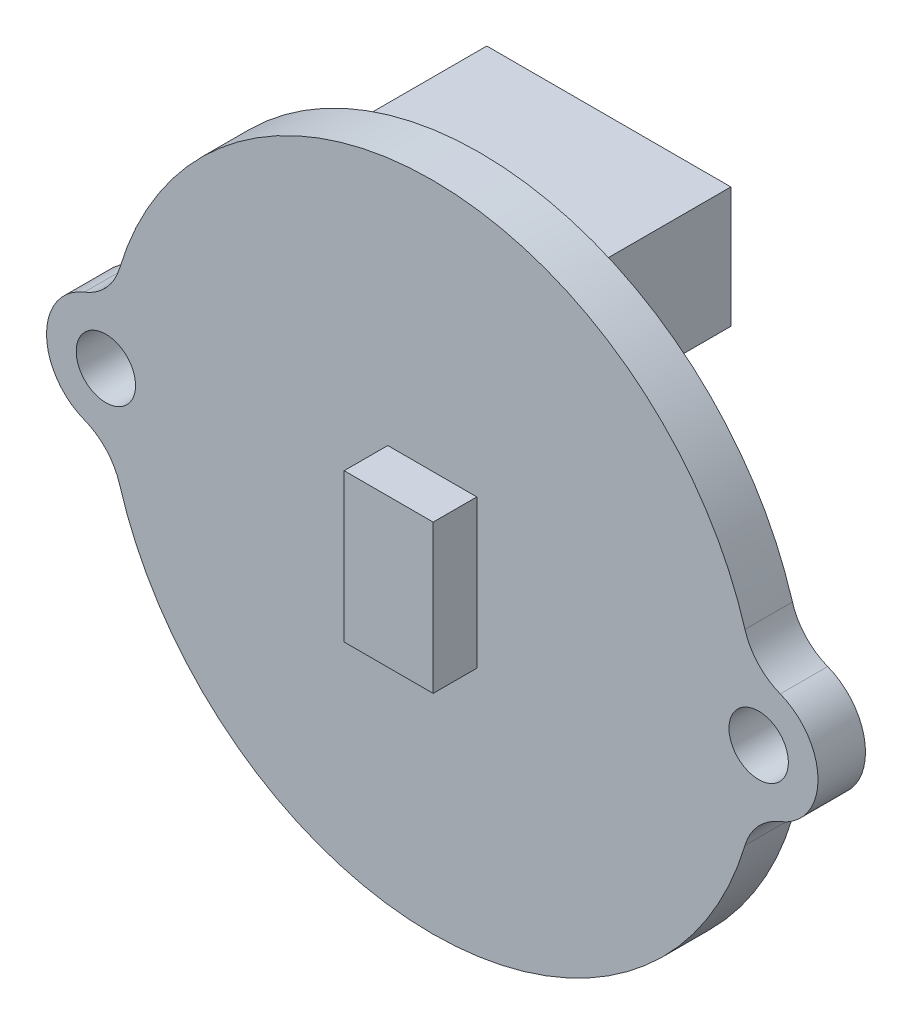
ISO-10303-21;
HEADER;
FILE_DESCRIPTION(('STEP AP214'),'2;1');
FILE_NAME('part.step','',(''),(''),'','','');
FILE_SCHEMA(('AUTOMOTIVE_DESIGN { 1 0 10303 214 1 1 1 1 }'));
ENDSEC;
DATA;
#1=APPLICATION_CONTEXT('core data for automotive mechanical design processes');
#2=APPLICATION_PROTOCOL_DEFINITION('international standard','automotive_design',2000,#1);
#3=PRODUCT_CONTEXT('',#1,'mechanical');
#4=PRODUCT('Part','Part','',(#3));
#5=PRODUCT_RELATED_PRODUCT_CATEGORY('part','',(#4));
#6=PRODUCT_DEFINITION_FORMATION('','',#4);
#7=PRODUCT_DEFINITION_CONTEXT('part definition',#1,'design');
#8=PRODUCT_DEFINITION('design','',#6,#7);
#9=PRODUCT_DEFINITION_SHAPE('','',#8);
#10=(LENGTH_UNIT() NAMED_UNIT(*) SI_UNIT(.MILLI.,.METRE.));
#11=(NAMED_UNIT(*) PLANE_ANGLE_UNIT() SI_UNIT($,.RADIAN.));
#12=(NAMED_UNIT(*) SI_UNIT($,.STERADIAN.) SOLID_ANGLE_UNIT());
#13=UNCERTAINTY_MEASURE_WITH_UNIT(LENGTH_MEASURE(1.E-05),#10,'distance_accuracy_value','');
#14=(GEOMETRIC_REPRESENTATION_CONTEXT(3) GLOBAL_UNCERTAINTY_ASSIGNED_CONTEXT((#13)) GLOBAL_UNIT_ASSIGNED_CONTEXT((#10,
#11,#12)) REPRESENTATION_CONTEXT('',''));
#15=CARTESIAN_POINT('',(0.,0.,0.));
#16=DIRECTION('',(0.,0.,1.));
#17=DIRECTION('',(1.,0.,0.));
#18=AXIS2_PLACEMENT_3D('',#15,#16,#17);
#19=CARTESIAN_POINT('',(11.7272727272727,1.8630819574472,0.));
#20=DIRECTION('',(0.,0.,1.));
#21=DIRECTION('',(1.,0.,0.));
#22=AXIS2_PLACEMENT_3D('',#19,#20,#21);
#23=PLANE('',#22);
#24=CARTESIAN_POINT('',(11.,0.,0.));
#25=DIRECTION('',(0.,0.,1.));
#26=DIRECTION('',(-1.,0.,0.));
#27=AXIS2_PLACEMENT_3D('',#24,#25,#26);
#28=CIRCLE('',#27,1.);
#29=CARTESIAN_POINT('',(10.,0.,0.));
#30=VERTEX_POINT('',#29);
#31=EDGE_CURVE('E201',#30,#30,#28,.T.);
#32=ORIENTED_EDGE('',*,*,#31,.T.);
#33=EDGE_LOOP('',(#32));
#34=FACE_BOUND('',#33,.T.);
#35=CARTESIAN_POINT('',(-11.,0.,0.));
#36=DIRECTION('',(0.,0.,1.));
#37=DIRECTION('',(1.,0.,0.));
#38=AXIS2_PLACEMENT_3D('',#35,#36,#37);
#39=CIRCLE('',#38,1.);
#40=CARTESIAN_POINT('',(-10.,0.,0.));
#41=VERTEX_POINT('',#40);
#42=EDGE_CURVE('E205',#41,#41,#39,.T.);
#43=ORIENTED_EDGE('',*,*,#42,.T.);
#44=EDGE_LOOP('',(#43));
#45=FACE_BOUND('',#44,.T.);
#46=CARTESIAN_POINT('',(12.4545454545455,3.7261639148944,0.));
#47=DIRECTION('',(0.,0.,-1.));
#48=DIRECTION('',(1.,0.,0.));
#49=AXIS2_PLACEMENT_3D('',#46,#47,#48);
#50=CIRCLE('',#49,2.);
#51=CARTESIAN_POINT('',(11.7272727272727,1.8630819574472,0.));
#52=VERTEX_POINT('',#51);
#53=CARTESIAN_POINT('',(10.5384615384615,3.15290792798757,0.));
#54=VERTEX_POINT('',#53);
#55=EDGE_CURVE('E211',#52,#54,#50,.T.);
#56=ORIENTED_EDGE('',*,*,#55,.F.);
#57=CARTESIAN_POINT('',(11.,0.,0.));
#58=DIRECTION('',(0.,0.,1.));
#59=DIRECTION('',(-1.,0.,0.));
#60=AXIS2_PLACEMENT_3D('',#57,#58,#59);
#61=CIRCLE('',#60,2.);
#62=CARTESIAN_POINT('',(11.7272727272727,-1.8630819574472,0.));
#63=VERTEX_POINT('',#62);
#64=EDGE_CURVE('E218',#63,#52,#61,.T.);
#65=ORIENTED_EDGE('',*,*,#64,.F.);
#66=CARTESIAN_POINT('',(12.4545454545455,-3.7261639148944,0.));
#67=DIRECTION('',(0.,0.,-1.));
#68=DIRECTION('',(-1.,0.,0.));
#69=AXIS2_PLACEMENT_3D('',#66,#67,#68);
#70=CIRCLE('',#69,2.);
#71=CARTESIAN_POINT('',(10.5384615384615,-3.15290792798757,0.));
#72=VERTEX_POINT('',#71);
#73=EDGE_CURVE('E245',#72,#63,#70,.T.);
#74=ORIENTED_EDGE('',*,*,#73,.F.);
#75=CARTESIAN_POINT('',(0.,0.,0.));
#76=DIRECTION('',(0.,0.,1.));
#77=DIRECTION('',(1.,0.,0.));
#78=AXIS2_PLACEMENT_3D('',#75,#76,#77);
#79=CIRCLE('',#78,11.);
#80=CARTESIAN_POINT('',(-10.5384615384615,-3.15290792798758,0.));
#81=VERTEX_POINT('',#80);
#82=EDGE_CURVE('E243',#81,#72,#79,.T.);
#83=ORIENTED_EDGE('',*,*,#82,.F.);
#84=CARTESIAN_POINT('',(-12.4545454545455,-3.72616391489441,0.));
#85=DIRECTION('',(0.,0.,-1.));
#86=DIRECTION('',(1.,0.,0.));
#87=AXIS2_PLACEMENT_3D('',#84,#85,#86);
#88=CIRCLE('',#87,2.);
#89=CARTESIAN_POINT('',(-11.7272727272727,-1.8630819574472,0.));
#90=VERTEX_POINT('',#89);
#91=EDGE_CURVE('E241',#90,#81,#88,.T.);
#92=ORIENTED_EDGE('',*,*,#91,.F.);
#93=CARTESIAN_POINT('',(-11.,0.,0.));
#94=DIRECTION('',(0.,0.,1.));
#95=DIRECTION('',(1.,0.,0.));
#96=AXIS2_PLACEMENT_3D('',#93,#94,#95);
#97=CIRCLE('',#96,2.00000000000001);
#98=CARTESIAN_POINT('',(-11.7272727272727,1.8630819574472,0.));
#99=VERTEX_POINT('',#98);
#100=EDGE_CURVE('E239',#99,#90,#97,.T.);
#101=ORIENTED_EDGE('',*,*,#100,.F.);
#102=CARTESIAN_POINT('',(-12.4545454545455,3.7261639148944,0.));
#103=DIRECTION('',(0.,0.,-1.));
#104=DIRECTION('',(1.,0.,0.));
#105=AXIS2_PLACEMENT_3D('',#102,#103,#104);
#106=CIRCLE('',#105,2.);
#107=CARTESIAN_POINT('',(-10.5384615384615,3.15290792798757,0.));
#108=VERTEX_POINT('',#107);
#109=EDGE_CURVE('E237',#108,#99,#106,.T.);
#110=ORIENTED_EDGE('',*,*,#109,.F.);
#111=CARTESIAN_POINT('',(0.,0.,0.));
#112=DIRECTION('',(0.,0.,1.));
#113=DIRECTION('',(1.,0.,0.));
#114=AXIS2_PLACEMENT_3D('',#111,#112,#113);
#115=CIRCLE('',#114,11.);
#116=EDGE_CURVE('E235',#54,#108,#115,.T.);
#117=ORIENTED_EDGE('',*,*,#116,.F.);
#118=EDGE_LOOP('',(#56,#65,#74,#83,#92,#101,#110,#117));
#119=FACE_BOUND('',#118,.T.);
#120=DIRECTION('',(0.,-1.,0.));
#121=VECTOR('',#120,1.);
#122=CARTESIAN_POINT('',(4.113,9.879,0.));
#123=LINE('',#122,#121);
#124=CARTESIAN_POINT('',(4.113,9.879,0.));
#125=VERTEX_POINT('',#124);
#126=CARTESIAN_POINT('',(4.113,5.81,0.));
#127=VERTEX_POINT('',#126);
#128=EDGE_CURVE('E166',#125,#127,#123,.T.);
#129=ORIENTED_EDGE('',*,*,#128,.F.);
#130=DIRECTION('',(1.,0.,0.));
#131=VECTOR('',#130,1.);
#132=CARTESIAN_POINT('',(-4.113,9.879,0.));
#133=LINE('',#132,#131);
#134=CARTESIAN_POINT('',(-4.113,9.879,0.));
#135=VERTEX_POINT('',#134);
#136=EDGE_CURVE('E163',#135,#125,#133,.T.);
#137=ORIENTED_EDGE('',*,*,#136,.F.);
#138=DIRECTION('',(0.,1.,0.));
#139=VECTOR('',#138,1.);
#140=CARTESIAN_POINT('',(-4.113,9.879,0.));
#141=LINE('',#140,#139);
#142=CARTESIAN_POINT('',(-4.113,5.81,0.));
#143=VERTEX_POINT('',#142);
#144=EDGE_CURVE('E53',#143,#135,#141,.T.);
#145=ORIENTED_EDGE('',*,*,#144,.F.);
#146=DIRECTION('',(-1.,0.,0.));
#147=VECTOR('',#146,1.);
#148=CARTESIAN_POINT('',(-4.113,5.81,0.));
#149=LINE('',#148,#147);
#150=EDGE_CURVE('E48',#127,#143,#149,.T.);
#151=ORIENTED_EDGE('',*,*,#150,.F.);
#152=EDGE_LOOP('',(#129,#137,#145,#151));
#153=FACE_BOUND('',#152,.T.);
#154=ADVANCED_FACE('F33',(#34,#45,#119,#153),#23,.F.);
#155=CARTESIAN_POINT('',(11.7272727272727,1.8630819574472,1.6));
#156=DIRECTION('',(0.,0.,1.));
#157=DIRECTION('',(1.,0.,0.));
#158=AXIS2_PLACEMENT_3D('',#155,#156,#157);
#159=PLANE('',#158);
#160=CARTESIAN_POINT('',(-11.,0.,1.6));
#161=DIRECTION('',(0.,0.,1.));
#162=DIRECTION('',(1.,0.,0.));
#163=AXIS2_PLACEMENT_3D('',#160,#161,#162);
#164=CIRCLE('',#163,1.);
#165=CARTESIAN_POINT('',(-10.,0.,1.6));
#166=VERTEX_POINT('',#165);
#167=EDGE_CURVE('E208',#166,#166,#164,.T.);
#168=ORIENTED_EDGE('',*,*,#167,.F.);
#169=EDGE_LOOP('',(#168));
#170=FACE_BOUND('',#169,.T.);
#171=CARTESIAN_POINT('',(12.4545454545455,3.7261639148944,1.6));
#172=DIRECTION('',(0.,0.,-1.));
#173=DIRECTION('',(1.,0.,0.));
#174=AXIS2_PLACEMENT_3D('',#171,#172,#173);
#175=CIRCLE('',#174,2.);
#176=CARTESIAN_POINT('',(11.7272727272727,1.8630819574472,1.6));
#177=VERTEX_POINT('',#176);
#178=CARTESIAN_POINT('',(10.5384615384615,3.15290792798757,1.6));
#179=VERTEX_POINT('',#178);
#180=EDGE_CURVE('E214',#177,#179,#175,.T.);
#181=ORIENTED_EDGE('',*,*,#180,.T.);
#182=CARTESIAN_POINT('',(0.,0.,1.6));
#183=DIRECTION('',(0.,0.,1.));
#184=DIRECTION('',(1.,0.,0.));
#185=AXIS2_PLACEMENT_3D('',#182,#183,#184);
#186=CIRCLE('',#185,11.);
#187=CARTESIAN_POINT('',(-10.5384615384615,3.15290792798757,1.6));
#188=VERTEX_POINT('',#187);
#189=EDGE_CURVE('E217',#179,#188,#186,.T.);
#190=ORIENTED_EDGE('',*,*,#189,.T.);
#191=CARTESIAN_POINT('',(-12.4545454545455,3.7261639148944,1.6));
#192=DIRECTION('',(0.,0.,-1.));
#193=DIRECTION('',(1.,0.,0.));
#194=AXIS2_PLACEMENT_3D('',#191,#192,#193);
#195=CIRCLE('',#194,2.);
#196=CARTESIAN_POINT('',(-11.7272727272727,1.8630819574472,1.6));
#197=VERTEX_POINT('',#196);
#198=EDGE_CURVE('E220',#188,#197,#195,.T.);
#199=ORIENTED_EDGE('',*,*,#198,.T.);
#200=CARTESIAN_POINT('',(-11.,0.,1.6));
#201=DIRECTION('',(0.,0.,1.));
#202=DIRECTION('',(1.,0.,0.));
#203=AXIS2_PLACEMENT_3D('',#200,#201,#202);
#204=CIRCLE('',#203,2.00000000000001);
#205=CARTESIAN_POINT('',(-11.7272727272727,-1.8630819574472,1.6));
#206=VERTEX_POINT('',#205);
#207=EDGE_CURVE('E222',#197,#206,#204,.T.);
#208=ORIENTED_EDGE('',*,*,#207,.T.);
#209=CARTESIAN_POINT('',(-12.4545454545455,-3.72616391489441,1.6));
#210=DIRECTION('',(0.,0.,-1.));
#211=DIRECTION('',(1.,0.,0.));
#212=AXIS2_PLACEMENT_3D('',#209,#210,#211);
#213=CIRCLE('',#212,2.);
#214=CARTESIAN_POINT('',(-10.5384615384615,-3.15290792798758,1.6));
#215=VERTEX_POINT('',#214);
#216=EDGE_CURVE('E224',#206,#215,#213,.T.);
#217=ORIENTED_EDGE('',*,*,#216,.T.);
#218=CARTESIAN_POINT('',(0.,0.,1.6));
#219=DIRECTION('',(0.,0.,1.));
#220=DIRECTION('',(1.,0.,0.));
#221=AXIS2_PLACEMENT_3D('',#218,#219,#220);
#222=CIRCLE('',#221,11.);
#223=CARTESIAN_POINT('',(10.5384615384615,-3.15290792798757,1.6));
#224=VERTEX_POINT('',#223);
#225=EDGE_CURVE('E226',#215,#224,#222,.T.);
#226=ORIENTED_EDGE('',*,*,#225,.T.);
#227=CARTESIAN_POINT('',(12.4545454545455,-3.7261639148944,1.6));
#228=DIRECTION('',(0.,0.,-1.));
#229=DIRECTION('',(-1.,0.,0.));
#230=AXIS2_PLACEMENT_3D('',#227,#228,#229);
#231=CIRCLE('',#230,2.);
#232=CARTESIAN_POINT('',(11.7272727272727,-1.8630819574472,1.6));
#233=VERTEX_POINT('',#232);
#234=EDGE_CURVE('E228',#224,#233,#231,.T.);
#235=ORIENTED_EDGE('',*,*,#234,.T.);
#236=CARTESIAN_POINT('',(11.,0.,1.6));
#237=DIRECTION('',(0.,0.,1.));
#238=DIRECTION('',(-1.,0.,0.));
#239=AXIS2_PLACEMENT_3D('',#236,#237,#238);
#240=CIRCLE('',#239,2.);
#241=EDGE_CURVE('E230',#233,#177,#240,.T.);
#242=ORIENTED_EDGE('',*,*,#241,.T.);
#243=EDGE_LOOP('',(#181,#190,#199,#208,#217,#226,#235,#242));
#244=FACE_BOUND('',#243,.T.);
#245=CARTESIAN_POINT('',(11.,0.,1.6));
#246=DIRECTION('',(0.,0.,1.));
#247=DIRECTION('',(-1.,0.,0.));
#248=AXIS2_PLACEMENT_3D('',#245,#246,#247);
#249=CIRCLE('',#248,1.);
#250=CARTESIAN_POINT('',(10.,0.,1.6));
#251=VERTEX_POINT('',#250);
#252=EDGE_CURVE('E202',#251,#251,#249,.T.);
#253=ORIENTED_EDGE('',*,*,#252,.F.);
#254=EDGE_LOOP('',(#253));
#255=FACE_BOUND('',#254,.T.);
#256=DIRECTION('',(1.,0.,0.));
#257=VECTOR('',#256,1.);
#258=CARTESIAN_POINT('',(1.5,-2.5,1.6));
#259=LINE('',#258,#257);
#260=CARTESIAN_POINT('',(-1.5,-2.5,1.6));
#261=VERTEX_POINT('',#260);
#262=CARTESIAN_POINT('',(1.5,-2.5,1.6));
#263=VERTEX_POINT('',#262);
#264=EDGE_CURVE('E170',#261,#263,#259,.T.);
#265=ORIENTED_EDGE('',*,*,#264,.F.);
#266=DIRECTION('',(0.,-1.,0.));
#267=VECTOR('',#266,1.);
#268=CARTESIAN_POINT('',(-1.5,-2.5,1.6));
#269=LINE('',#268,#267);
#270=CARTESIAN_POINT('',(-1.5,2.5,1.6));
#271=VERTEX_POINT('',#270);
#272=EDGE_CURVE('E167',#271,#261,#269,.T.);
#273=ORIENTED_EDGE('',*,*,#272,.F.);
#274=DIRECTION('',(-1.,0.,0.));
#275=VECTOR('',#274,1.);
#276=CARTESIAN_POINT('',(1.5,2.5,1.6));
#277=LINE('',#276,#275);
#278=CARTESIAN_POINT('',(1.5,2.5,1.6));
#279=VERTEX_POINT('',#278);
#280=EDGE_CURVE('E180',#279,#271,#277,.T.);
#281=ORIENTED_EDGE('',*,*,#280,.F.);
#282=DIRECTION('',(0.,1.,0.));
#283=VECTOR('',#282,1.);
#284=CARTESIAN_POINT('',(1.5,-2.5,1.6));
#285=LINE('',#284,#283);
#286=EDGE_CURVE('E188',#263,#279,#285,.T.);
#287=ORIENTED_EDGE('',*,*,#286,.F.);
#288=EDGE_LOOP('',(#265,#273,#281,#287));
#289=FACE_BOUND('',#288,.T.);
#290=ADVANCED_FACE('F287',(#170,#244,#255,#289),#159,.T.);
#291=CARTESIAN_POINT('',(12.4545454545455,3.7261639148944,1.6));
#292=DIRECTION('',(0.,0.,-1.));
#293=DIRECTION('',(-1.,0.,0.));
#294=AXIS2_PLACEMENT_3D('',#291,#292,#293);
#295=CYLINDRICAL_SURFACE('',#294,2.);
#296=ORIENTED_EDGE('',*,*,#55,.T.);
#297=DIRECTION('',(0.,0.,-1.));
#298=VECTOR('',#297,1.);
#299=CARTESIAN_POINT('',(10.5384615384615,3.15290792798757,1.6));
#300=LINE('',#299,#298);
#301=EDGE_CURVE('E11',#179,#54,#300,.T.);
#302=ORIENTED_EDGE('',*,*,#301,.F.);
#303=ORIENTED_EDGE('',*,*,#180,.F.);
#304=DIRECTION('',(0.,0.,-1.));
#305=VECTOR('',#304,1.);
#306=CARTESIAN_POINT('',(11.7272727272727,1.8630819574472,1.6));
#307=LINE('',#306,#305);
#308=EDGE_CURVE('E232',#177,#52,#307,.T.);
#309=ORIENTED_EDGE('',*,*,#308,.T.);
#310=EDGE_LOOP('',(#296,#302,#303,#309));
#311=FACE_BOUND('',#310,.T.);
#312=ADVANCED_FACE('F35',(#311),#295,.F.);
#313=CARTESIAN_POINT('',(0.,0.,1.6));
#314=DIRECTION('',(0.,0.,-1.));
#315=DIRECTION('',(-1.,0.,0.));
#316=AXIS2_PLACEMENT_3D('',#313,#314,#315);
#317=CYLINDRICAL_SURFACE('',#316,11.);
#318=ORIENTED_EDGE('',*,*,#116,.T.);
#319=DIRECTION('',(0.,0.,-1.));
#320=VECTOR('',#319,1.);
#321=CARTESIAN_POINT('',(-10.5384615384615,3.15290792798757,1.6));
#322=LINE('',#321,#320);
#323=EDGE_CURVE('E41',#188,#108,#322,.T.);
#324=ORIENTED_EDGE('',*,*,#323,.F.);
#325=ORIENTED_EDGE('',*,*,#189,.F.);
#326=ORIENTED_EDGE('',*,*,#301,.T.);
#327=EDGE_LOOP('',(#318,#324,#325,#326));
#328=FACE_BOUND('',#327,.T.);
#329=ADVANCED_FACE('F292',(#328),#317,.T.);
#330=CARTESIAN_POINT('',(-12.4545454545455,3.7261639148944,1.6));
#331=DIRECTION('',(0.,0.,-1.));
#332=DIRECTION('',(-1.,0.,0.));
#333=AXIS2_PLACEMENT_3D('',#330,#331,#332);
#334=CYLINDRICAL_SURFACE('',#333,2.);
#335=ORIENTED_EDGE('',*,*,#109,.T.);
#336=DIRECTION('',(0.,0.,-1.));
#337=VECTOR('',#336,1.);
#338=CARTESIAN_POINT('',(-11.7272727272727,1.8630819574472,1.6));
#339=LINE('',#338,#337);
#340=EDGE_CURVE('E262',#197,#99,#339,.T.);
#341=ORIENTED_EDGE('',*,*,#340,.F.);
#342=ORIENTED_EDGE('',*,*,#198,.F.);
#343=ORIENTED_EDGE('',*,*,#323,.T.);
#344=EDGE_LOOP('',(#335,#341,#342,#343));
#345=FACE_BOUND('',#344,.T.);
#346=ADVANCED_FACE('F269',(#345),#334,.F.);
#347=CARTESIAN_POINT('',(-11.,0.,1.6));
#348=DIRECTION('',(0.,0.,-1.));
#349=DIRECTION('',(-1.,0.,0.));
#350=AXIS2_PLACEMENT_3D('',#347,#348,#349);
#351=CYLINDRICAL_SURFACE('',#350,2.00000000000001);
#352=ORIENTED_EDGE('',*,*,#100,.T.);
#353=DIRECTION('',(0.,0.,-1.));
#354=VECTOR('',#353,1.);
#355=CARTESIAN_POINT('',(-11.7272727272727,-1.8630819574472,1.6));
#356=LINE('',#355,#354);
#357=EDGE_CURVE('E259',#206,#90,#356,.T.);
#358=ORIENTED_EDGE('',*,*,#357,.F.);
#359=ORIENTED_EDGE('',*,*,#207,.F.);
#360=ORIENTED_EDGE('',*,*,#340,.T.);
#361=EDGE_LOOP('',(#352,#358,#359,#360));
#362=FACE_BOUND('',#361,.T.);
#363=ADVANCED_FACE('F279',(#362),#351,.T.);
#364=CARTESIAN_POINT('',(-12.4545454545455,-3.72616391489441,1.6));
#365=DIRECTION('',(0.,0.,-1.));
#366=DIRECTION('',(-1.,0.,0.));
#367=AXIS2_PLACEMENT_3D('',#364,#365,#366);
#368=CYLINDRICAL_SURFACE('',#367,2.);
#369=ORIENTED_EDGE('',*,*,#91,.T.);
#370=DIRECTION('',(0.,0.,-1.));
#371=VECTOR('',#370,1.);
#372=CARTESIAN_POINT('',(-10.5384615384615,-3.15290792798758,1.6));
#373=LINE('',#372,#371);
#374=EDGE_CURVE('E256',#215,#81,#373,.T.);
#375=ORIENTED_EDGE('',*,*,#374,.F.);
#376=ORIENTED_EDGE('',*,*,#216,.F.);
#377=ORIENTED_EDGE('',*,*,#357,.T.);
#378=EDGE_LOOP('',(#369,#375,#376,#377));
#379=FACE_BOUND('',#378,.T.);
#380=ADVANCED_FACE('F283',(#379),#368,.F.);
#381=CARTESIAN_POINT('',(0.,0.,1.6));
#382=DIRECTION('',(0.,0.,-1.));
#383=DIRECTION('',(-1.,0.,0.));
#384=AXIS2_PLACEMENT_3D('',#381,#382,#383);
#385=CYLINDRICAL_SURFACE('',#384,11.);
#386=ORIENTED_EDGE('',*,*,#82,.T.);
#387=DIRECTION('',(0.,0.,-1.));
#388=VECTOR('',#387,1.);
#389=CARTESIAN_POINT('',(10.5384615384615,-3.15290792798757,1.6));
#390=LINE('',#389,#388);
#391=EDGE_CURVE('E253',#224,#72,#390,.T.);
#392=ORIENTED_EDGE('',*,*,#391,.F.);
#393=ORIENTED_EDGE('',*,*,#225,.F.);
#394=ORIENTED_EDGE('',*,*,#374,.T.);
#395=EDGE_LOOP('',(#386,#392,#393,#394));
#396=FACE_BOUND('',#395,.T.);
#397=ADVANCED_FACE('F305',(#396),#385,.T.);
#398=CARTESIAN_POINT('',(12.4545454545455,-3.7261639148944,1.6));
#399=DIRECTION('',(0.,0.,-1.));
#400=DIRECTION('',(-1.,0.,0.));
#401=AXIS2_PLACEMENT_3D('',#398,#399,#400);
#402=CYLINDRICAL_SURFACE('',#401,2.);
#403=ORIENTED_EDGE('',*,*,#73,.T.);
#404=DIRECTION('',(0.,0.,-1.));
#405=VECTOR('',#404,1.);
#406=CARTESIAN_POINT('',(11.7272727272727,-1.8630819574472,1.6));
#407=LINE('',#406,#405);
#408=EDGE_CURVE('E250',#233,#63,#407,.T.);
#409=ORIENTED_EDGE('',*,*,#408,.F.);
#410=ORIENTED_EDGE('',*,*,#234,.F.);
#411=ORIENTED_EDGE('',*,*,#391,.T.);
#412=EDGE_LOOP('',(#403,#409,#410,#411));
#413=FACE_BOUND('',#412,.T.);
#414=ADVANCED_FACE('F303',(#413),#402,.F.);
#415=CARTESIAN_POINT('',(11.,0.,1.6));
#416=DIRECTION('',(0.,0.,-1.));
#417=DIRECTION('',(-1.,0.,0.));
#418=AXIS2_PLACEMENT_3D('',#415,#416,#417);
#419=CYLINDRICAL_SURFACE('',#418,2.);
#420=ORIENTED_EDGE('',*,*,#64,.T.);
#421=ORIENTED_EDGE('',*,*,#308,.F.);
#422=ORIENTED_EDGE('',*,*,#241,.F.);
#423=ORIENTED_EDGE('',*,*,#408,.T.);
#424=EDGE_LOOP('',(#420,#421,#422,#423));
#425=FACE_BOUND('',#424,.T.);
#426=ADVANCED_FACE('F298',(#425),#419,.T.);
#427=CARTESIAN_POINT('',(-11.,0.,1.6));
#428=DIRECTION('',(0.,0.,-1.));
#429=DIRECTION('',(-1.,0.,0.));
#430=AXIS2_PLACEMENT_3D('',#427,#428,#429);
#431=CYLINDRICAL_SURFACE('',#430,1.);
#432=ORIENTED_EDGE('',*,*,#167,.T.);
#433=EDGE_LOOP('',(#432));
#434=FACE_BOUND('',#433,.T.);
#435=ORIENTED_EDGE('',*,*,#42,.F.);
#436=EDGE_LOOP('',(#435));
#437=FACE_BOUND('',#436,.T.);
#438=ADVANCED_FACE('F326',(#434,#437),#431,.F.);
#439=CARTESIAN_POINT('',(11.,0.,1.6));
#440=DIRECTION('',(0.,0.,-1.));
#441=DIRECTION('',(-1.,0.,0.));
#442=AXIS2_PLACEMENT_3D('',#439,#440,#441);
#443=CYLINDRICAL_SURFACE('',#442,1.);
#444=ORIENTED_EDGE('',*,*,#252,.T.);
#445=EDGE_LOOP('',(#444));
#446=FACE_BOUND('',#445,.T.);
#447=ORIENTED_EDGE('',*,*,#31,.F.);
#448=EDGE_LOOP('',(#447));
#449=FACE_BOUND('',#448,.T.);
#450=ADVANCED_FACE('F330',(#446,#449),#443,.F.);
#451=CARTESIAN_POINT('',(-1.5,-2.5,3.07));
#452=DIRECTION('',(1.,0.,0.));
#453=DIRECTION('',(0.,0.,-1.));
#454=AXIS2_PLACEMENT_3D('',#451,#452,#453);
#455=PLANE('',#454);
#456=ORIENTED_EDGE('',*,*,#272,.T.);
#457=DIRECTION('',(0.,0.,-1.));
#458=VECTOR('',#457,1.);
#459=CARTESIAN_POINT('',(-1.5,-2.5,3.07));
#460=LINE('',#459,#458);
#461=CARTESIAN_POINT('',(-1.5,-2.5,3.07));
#462=VERTEX_POINT('',#461);
#463=EDGE_CURVE('E199',#462,#261,#460,.T.);
#464=ORIENTED_EDGE('',*,*,#463,.F.);
#465=DIRECTION('',(0.,-1.,0.));
#466=VECTOR('',#465,1.);
#467=CARTESIAN_POINT('',(-1.5,-2.5,3.07));
#468=LINE('',#467,#466);
#469=CARTESIAN_POINT('',(-1.5,2.5,3.07));
#470=VERTEX_POINT('',#469);
#471=EDGE_CURVE('E176',#470,#462,#468,.T.);
#472=ORIENTED_EDGE('',*,*,#471,.F.);
#473=DIRECTION('',(0.,0.,-1.));
#474=VECTOR('',#473,1.);
#475=CARTESIAN_POINT('',(-1.5,2.5,3.07));
#476=LINE('',#475,#474);
#477=EDGE_CURVE('E185',#470,#271,#476,.T.);
#478=ORIENTED_EDGE('',*,*,#477,.T.);
#479=EDGE_LOOP('',(#456,#464,#472,#478));
#480=FACE_BOUND('',#479,.T.);
#481=ADVANCED_FACE('F335',(#480),#455,.F.);
#482=CARTESIAN_POINT('',(1.5,-2.5,3.07));
#483=DIRECTION('',(0.,1.,0.));
#484=DIRECTION('',(0.,0.,1.));
#485=AXIS2_PLACEMENT_3D('',#482,#483,#484);
#486=PLANE('',#485);
#487=ORIENTED_EDGE('',*,*,#264,.T.);
#488=DIRECTION('',(0.,0.,-1.));
#489=VECTOR('',#488,1.);
#490=CARTESIAN_POINT('',(1.5,-2.5,3.07));
#491=LINE('',#490,#489);
#492=CARTESIAN_POINT('',(1.5,-2.5,3.07));
#493=VERTEX_POINT('',#492);
#494=EDGE_CURVE('E196',#493,#263,#491,.T.);
#495=ORIENTED_EDGE('',*,*,#494,.F.);
#496=DIRECTION('',(1.,0.,0.));
#497=VECTOR('',#496,1.);
#498=CARTESIAN_POINT('',(1.5,-2.5,3.07));
#499=LINE('',#498,#497);
#500=EDGE_CURVE('E179',#462,#493,#499,.T.);
#501=ORIENTED_EDGE('',*,*,#500,.F.);
#502=ORIENTED_EDGE('',*,*,#463,.T.);
#503=EDGE_LOOP('',(#487,#495,#501,#502));
#504=FACE_BOUND('',#503,.T.);
#505=ADVANCED_FACE('F342',(#504),#486,.F.);
#506=CARTESIAN_POINT('',(1.5,-2.5,3.07));
#507=DIRECTION('',(-1.,0.,0.));
#508=DIRECTION('',(0.,0.,1.));
#509=AXIS2_PLACEMENT_3D('',#506,#507,#508);
#510=PLANE('',#509);
#511=ORIENTED_EDGE('',*,*,#286,.T.);
#512=DIRECTION('',(0.,0.,-1.));
#513=VECTOR('',#512,1.);
#514=CARTESIAN_POINT('',(1.5,2.5,3.07));
#515=LINE('',#514,#513);
#516=CARTESIAN_POINT('',(1.5,2.5,3.07));
#517=VERTEX_POINT('',#516);
#518=EDGE_CURVE('E194',#517,#279,#515,.T.);
#519=ORIENTED_EDGE('',*,*,#518,.F.);
#520=DIRECTION('',(0.,1.,0.));
#521=VECTOR('',#520,1.);
#522=CARTESIAN_POINT('',(1.5,-2.5,3.07));
#523=LINE('',#522,#521);
#524=EDGE_CURVE('E182',#493,#517,#523,.T.);
#525=ORIENTED_EDGE('',*,*,#524,.F.);
#526=ORIENTED_EDGE('',*,*,#494,.T.);
#527=EDGE_LOOP('',(#511,#519,#525,#526));
#528=FACE_BOUND('',#527,.T.);
#529=ADVANCED_FACE('F346',(#528),#510,.F.);
#530=CARTESIAN_POINT('',(1.5,2.5,3.07));
#531=DIRECTION('',(0.,-1.,0.));
#532=DIRECTION('',(1.,0.,0.));
#533=AXIS2_PLACEMENT_3D('',#530,#531,#532);
#534=PLANE('',#533);
#535=ORIENTED_EDGE('',*,*,#280,.T.);
#536=ORIENTED_EDGE('',*,*,#477,.F.);
#537=DIRECTION('',(-1.,0.,0.));
#538=VECTOR('',#537,1.);
#539=CARTESIAN_POINT('',(1.5,2.5,3.07));
#540=LINE('',#539,#538);
#541=EDGE_CURVE('E184',#517,#470,#540,.T.);
#542=ORIENTED_EDGE('',*,*,#541,.F.);
#543=ORIENTED_EDGE('',*,*,#518,.T.);
#544=EDGE_LOOP('',(#535,#536,#542,#543));
#545=FACE_BOUND('',#544,.T.);
#546=ADVANCED_FACE('F350',(#545),#534,.F.);
#547=CARTESIAN_POINT('',(0.,0.,3.07));
#548=DIRECTION('',(0.,0.,1.));
#549=DIRECTION('',(1.,0.,0.));
#550=AXIS2_PLACEMENT_3D('',#547,#548,#549);
#551=PLANE('',#550);
#552=ORIENTED_EDGE('',*,*,#471,.T.);
#553=ORIENTED_EDGE('',*,*,#500,.T.);
#554=ORIENTED_EDGE('',*,*,#524,.T.);
#555=ORIENTED_EDGE('',*,*,#541,.T.);
#556=EDGE_LOOP('',(#552,#553,#554,#555));
#557=FACE_BOUND('',#556,.T.);
#558=ADVANCED_FACE('F354',(#557),#551,.T.);
#559=CARTESIAN_POINT('',(4.113,9.879,-4.35));
#560=DIRECTION('',(-1.,0.,0.));
#561=DIRECTION('',(0.,-1.,0.));
#562=AXIS2_PLACEMENT_3D('',#559,#560,#561);
#563=PLANE('',#562);
#564=ORIENTED_EDGE('',*,*,#128,.T.);
#565=DIRECTION('',(0.,0.,1.));
#566=VECTOR('',#565,1.);
#567=CARTESIAN_POINT('',(4.113,5.81,-4.35));
#568=LINE('',#567,#566);
#569=CARTESIAN_POINT('',(4.113,5.81,-4.35));
#570=VERTEX_POINT('',#569);
#571=EDGE_CURVE('E147',#570,#127,#568,.T.);
#572=ORIENTED_EDGE('',*,*,#571,.F.);
#573=DIRECTION('',(0.,-1.,0.));
#574=VECTOR('',#573,1.);
#575=CARTESIAN_POINT('',(4.113,9.879,-4.35));
#576=LINE('',#575,#574);
#577=CARTESIAN_POINT('',(4.113,9.879,-4.35));
#578=VERTEX_POINT('',#577);
#579=EDGE_CURVE('E154',#578,#570,#576,.T.);
#580=ORIENTED_EDGE('',*,*,#579,.F.);
#581=DIRECTION('',(0.,0.,1.));
#582=VECTOR('',#581,1.);
#583=CARTESIAN_POINT('',(4.113,9.879,-4.35));
#584=LINE('',#583,#582);
#585=EDGE_CURVE('E504',#578,#125,#584,.T.);
#586=ORIENTED_EDGE('',*,*,#585,.T.);
#587=EDGE_LOOP('',(#564,#572,#580,#586));
#588=FACE_BOUND('',#587,.T.);
#589=ADVANCED_FACE('F165',(#588),#563,.F.);
#590=CARTESIAN_POINT('',(-4.113,5.81,-4.35));
#591=DIRECTION('',(0.,1.,0.));
#592=DIRECTION('',(-1.,0.,0.));
#593=AXIS2_PLACEMENT_3D('',#590,#591,#592);
#594=PLANE('',#593);
#595=ORIENTED_EDGE('',*,*,#150,.T.);
#596=DIRECTION('',(0.,0.,1.));
#597=VECTOR('',#596,1.);
#598=CARTESIAN_POINT('',(-4.113,5.81,-4.35));
#599=LINE('',#598,#597);
#600=CARTESIAN_POINT('',(-4.113,5.81,-4.35));
#601=VERTEX_POINT('',#600);
#602=EDGE_CURVE('E150',#601,#143,#599,.T.);
#603=ORIENTED_EDGE('',*,*,#602,.F.);
#604=DIRECTION('',(-1.,0.,0.));
#605=VECTOR('',#604,1.);
#606=CARTESIAN_POINT('',(-4.113,5.81,-4.35));
#607=LINE('',#606,#605);
#608=EDGE_CURVE('E143',#570,#601,#607,.T.);
#609=ORIENTED_EDGE('',*,*,#608,.F.);
#610=ORIENTED_EDGE('',*,*,#571,.T.);
#611=EDGE_LOOP('',(#595,#603,#609,#610));
#612=FACE_BOUND('',#611,.T.);
#613=ADVANCED_FACE('F145',(#612),#594,.F.);
#614=CARTESIAN_POINT('',(-4.113,9.879,-4.35));
#615=DIRECTION('',(1.,0.,0.));
#616=DIRECTION('',(0.,0.,-1.));
#617=AXIS2_PLACEMENT_3D('',#614,#615,#616);
#618=PLANE('',#617);
#619=ORIENTED_EDGE('',*,*,#144,.T.);
#620=DIRECTION('',(0.,0.,1.));
#621=VECTOR('',#620,1.);
#622=CARTESIAN_POINT('',(-4.113,9.879,-4.35));
#623=LINE('',#622,#621);
#624=CARTESIAN_POINT('',(-4.113,9.879,-4.35));
#625=VERTEX_POINT('',#624);
#626=EDGE_CURVE('E172',#625,#135,#623,.T.);
#627=ORIENTED_EDGE('',*,*,#626,.F.);
#628=DIRECTION('',(0.,1.,0.));
#629=VECTOR('',#628,1.);
#630=CARTESIAN_POINT('',(-4.113,9.879,-4.35));
#631=LINE('',#630,#629);
#632=EDGE_CURVE('E153',#601,#625,#631,.T.);
#633=ORIENTED_EDGE('',*,*,#632,.F.);
#634=ORIENTED_EDGE('',*,*,#602,.T.);
#635=EDGE_LOOP('',(#619,#627,#633,#634));
#636=FACE_BOUND('',#635,.T.);
#637=ADVANCED_FACE('F363',(#636),#618,.F.);
#638=CARTESIAN_POINT('',(-4.113,9.879,-4.35));
#639=DIRECTION('',(0.,-1.,0.));
#640=DIRECTION('',(1.,0.,0.));
#641=AXIS2_PLACEMENT_3D('',#638,#639,#640);
#642=PLANE('',#641);
#643=ORIENTED_EDGE('',*,*,#136,.T.);
#644=ORIENTED_EDGE('',*,*,#585,.F.);
#645=DIRECTION('',(1.,0.,0.));
#646=VECTOR('',#645,1.);
#647=CARTESIAN_POINT('',(-4.113,9.879,-4.35));
#648=LINE('',#647,#646);
#649=EDGE_CURVE('E159',#625,#578,#648,.T.);
#650=ORIENTED_EDGE('',*,*,#649,.F.);
#651=ORIENTED_EDGE('',*,*,#626,.T.);
#652=EDGE_LOOP('',(#643,#644,#650,#651));
#653=FACE_BOUND('',#652,.T.);
#654=ADVANCED_FACE('F366',(#653),#642,.F.);
#655=CARTESIAN_POINT('',(0.,0.,-4.35));
#656=DIRECTION('',(0.,0.,1.));
#657=DIRECTION('',(1.,0.,0.));
#658=AXIS2_PLACEMENT_3D('',#655,#656,#657);
#659=PLANE('',#658);
#660=ORIENTED_EDGE('',*,*,#579,.T.);
#661=ORIENTED_EDGE('',*,*,#608,.T.);
#662=ORIENTED_EDGE('',*,*,#632,.T.);
#663=ORIENTED_EDGE('',*,*,#649,.T.);
#664=EDGE_LOOP('',(#660,#661,#662,#663));
#665=FACE_BOUND('',#664,.T.);
#666=ADVANCED_FACE('F157',(#665),#659,.F.);
#667=CLOSED_SHELL('',(#154,#290,#312,#329,#346,#363,#380,#397,#414,#426,#438,#450,#481,#505,
#529,#546,#558,#589,#613,#637,#654,#666));
#668=MANIFOLD_SOLID_BREP('B2',#667);
#669=ADVANCED_BREP_SHAPE_REPRESENTATION('',(#18,#668),#14);
#670=SHAPE_DEFINITION_REPRESENTATION(#9,#669);
ENDSEC;
END-ISO-10303-21;
